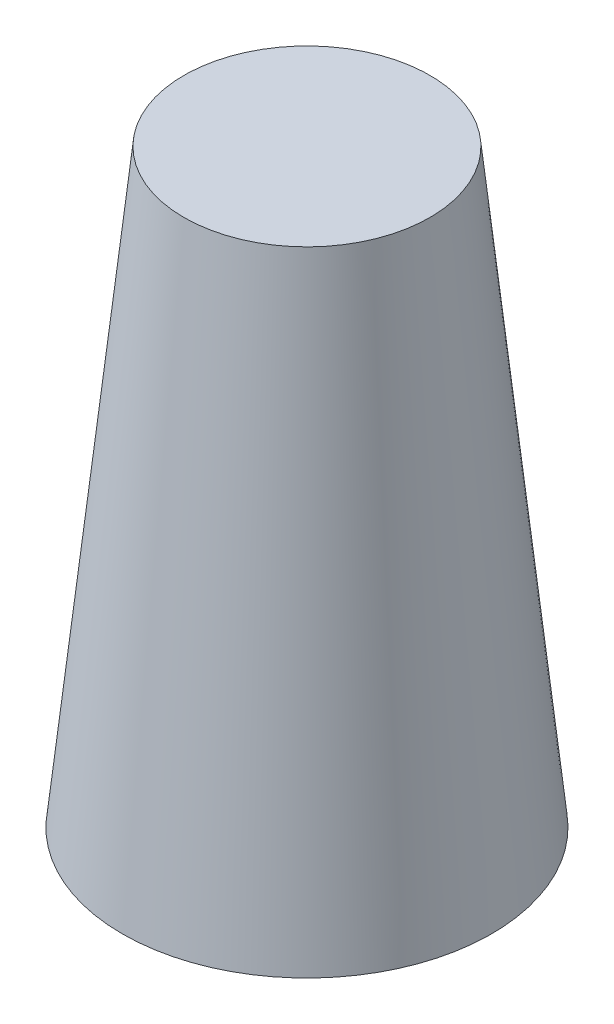
ISO-10303-21;
HEADER;
FILE_DESCRIPTION(('STEP AP214'),'2;1');
FILE_NAME('part.step','',(''),(''),'','','');
FILE_SCHEMA(('AUTOMOTIVE_DESIGN { 1 0 10303 214 1 1 1 1 }'));
ENDSEC;
DATA;
#1=APPLICATION_CONTEXT('core data for automotive mechanical design processes');
#2=APPLICATION_PROTOCOL_DEFINITION('international standard','automotive_design',2000,#1);
#3=PRODUCT_CONTEXT('',#1,'mechanical');
#4=PRODUCT('Part','Part','',(#3));
#5=PRODUCT_RELATED_PRODUCT_CATEGORY('part','',(#4));
#6=PRODUCT_DEFINITION_FORMATION('','',#4);
#7=PRODUCT_DEFINITION_CONTEXT('part definition',#1,'design');
#8=PRODUCT_DEFINITION('design','',#6,#7);
#9=PRODUCT_DEFINITION_SHAPE('','',#8);
#10=(LENGTH_UNIT() NAMED_UNIT(*) SI_UNIT(.MILLI.,.METRE.));
#11=(NAMED_UNIT(*) PLANE_ANGLE_UNIT() SI_UNIT($,.RADIAN.));
#12=(NAMED_UNIT(*) SI_UNIT($,.STERADIAN.) SOLID_ANGLE_UNIT());
#13=UNCERTAINTY_MEASURE_WITH_UNIT(LENGTH_MEASURE(1.E-05),#10,'distance_accuracy_value','');
#14=(GEOMETRIC_REPRESENTATION_CONTEXT(3) GLOBAL_UNCERTAINTY_ASSIGNED_CONTEXT((#13)) GLOBAL_UNIT_ASSIGNED_CONTEXT((#10,
#11,#12)) REPRESENTATION_CONTEXT('',''));
#15=CARTESIAN_POINT('',(0.,0.,0.));
#16=DIRECTION('',(0.,0.,1.));
#17=DIRECTION('',(1.,0.,0.));
#18=AXIS2_PLACEMENT_3D('',#15,#16,#17);
#19=CARTESIAN_POINT('',(0.,115.,0.));
#20=DIRECTION('',(0.,-1.,0.));
#21=DIRECTION('',(0.,0.,-1.));
#22=AXIS2_PLACEMENT_3D('',#19,#20,#21);
#23=PLANE('',#22);
#24=CARTESIAN_POINT('',(0.,115.,0.));
#25=DIRECTION('',(0.,1.,0.));
#26=DIRECTION('',(0.,0.,1.));
#27=AXIS2_PLACEMENT_3D('',#24,#25,#26);
#28=CIRCLE('',#27,24.);
#29=CARTESIAN_POINT('',(0.,115.,24.));
#30=VERTEX_POINT('',#29);
#31=EDGE_CURVE('E10',#30,#30,#28,.T.);
#32=ORIENTED_EDGE('',*,*,#31,.T.);
#33=EDGE_LOOP('',(#32));
#34=FACE_BOUND('',#33,.T.);
#35=ADVANCED_FACE('F31',(#34),#23,.F.);
#36=CARTESIAN_POINT('',(0.,0.,0.));
#37=DIRECTION('',(0.,-1.,0.));
#38=DIRECTION('',(0.,0.,-1.));
#39=AXIS2_PLACEMENT_3D('',#36,#37,#38);
#40=CONICAL_SURFACE('',#39,36.,0.103971551924658);
#41=ORIENTED_EDGE('',*,*,#31,.F.);
#42=EDGE_LOOP('',(#41));
#43=FACE_BOUND('',#42,.T.);
#44=CARTESIAN_POINT('',(0.,0.,0.));
#45=DIRECTION('',(0.,1.,0.));
#46=DIRECTION('',(0.,0.,1.));
#47=AXIS2_PLACEMENT_3D('',#44,#45,#46);
#48=CIRCLE('',#47,36.);
#49=CARTESIAN_POINT('',(0.,0.,36.));
#50=VERTEX_POINT('',#49);
#51=EDGE_CURVE('E37',#50,#50,#48,.T.);
#52=ORIENTED_EDGE('',*,*,#51,.T.);
#53=EDGE_LOOP('',(#52));
#54=FACE_BOUND('',#53,.T.);
#55=ADVANCED_FACE('F63',(#43,#54),#40,.T.);
#56=CARTESIAN_POINT('',(36.,0.,0.));
#57=DIRECTION('',(0.,1.,0.));
#58=DIRECTION('',(0.,0.,1.));
#59=AXIS2_PLACEMENT_3D('',#56,#57,#58);
#60=PLANE('',#59);
#61=ORIENTED_EDGE('',*,*,#51,.F.);
#62=EDGE_LOOP('',(#61));
#63=FACE_BOUND('',#62,.T.);
#64=CARTESIAN_POINT('',(0.,0.,0.));
#65=DIRECTION('',(0.,1.,0.));
#66=DIRECTION('',(0.,0.,1.));
#67=AXIS2_PLACEMENT_3D('',#64,#65,#66);
#68=CIRCLE('',#67,34.4918557579527);
#69=CARTESIAN_POINT('',(0.,0.,34.4918557579527));
#70=VERTEX_POINT('',#69);
#71=EDGE_CURVE('E41',#70,#70,#68,.T.);
#72=ORIENTED_EDGE('',*,*,#71,.T.);
#73=EDGE_LOOP('',(#72));
#74=FACE_BOUND('',#73,.T.);
#75=ADVANCED_FACE('F59',(#63,#74),#60,.F.);
#76=CARTESIAN_POINT('',(0.,113.5,0.));
#77=DIRECTION('',(0.,-1.,0.));
#78=DIRECTION('',(0.,0.,-1.));
#79=AXIS2_PLACEMENT_3D('',#76,#77,#78);
#80=CONICAL_SURFACE('',#79,22.6483774970831,0.103971551924658);
#81=ORIENTED_EDGE('',*,*,#71,.F.);
#82=EDGE_LOOP('',(#81));
#83=FACE_BOUND('',#82,.T.);
#84=CARTESIAN_POINT('',(0.,113.5,0.));
#85=DIRECTION('',(0.,1.,0.));
#86=DIRECTION('',(0.,0.,1.));
#87=AXIS2_PLACEMENT_3D('',#84,#85,#86);
#88=CIRCLE('',#87,22.6483774970831);
#89=CARTESIAN_POINT('',(0.,113.5,22.6483774970831));
#90=VERTEX_POINT('',#89);
#91=EDGE_CURVE('E45',#90,#90,#88,.T.);
#92=ORIENTED_EDGE('',*,*,#91,.T.);
#93=EDGE_LOOP('',(#92));
#94=FACE_BOUND('',#93,.T.);
#95=ADVANCED_FACE('F51',(#83,#94),#80,.F.);
#96=CARTESIAN_POINT('',(22.6483774970831,113.5,0.));
#97=DIRECTION('',(0.,1.,0.));
#98=DIRECTION('',(0.,0.,1.));
#99=AXIS2_PLACEMENT_3D('',#96,#97,#98);
#100=PLANE('',#99);
#101=ORIENTED_EDGE('',*,*,#91,.F.);
#102=EDGE_LOOP('',(#101));
#103=FACE_BOUND('',#102,.T.);
#104=ADVANCED_FACE('F53',(#103),#100,.F.);
#105=CLOSED_SHELL('',(#35,#55,#75,#95,#104));
#106=MANIFOLD_SOLID_BREP('B2',#105);
#107=ADVANCED_BREP_SHAPE_REPRESENTATION('',(#18,#106),#14);
#108=SHAPE_DEFINITION_REPRESENTATION(#9,#107);
ENDSEC;
END-ISO-10303-21;
